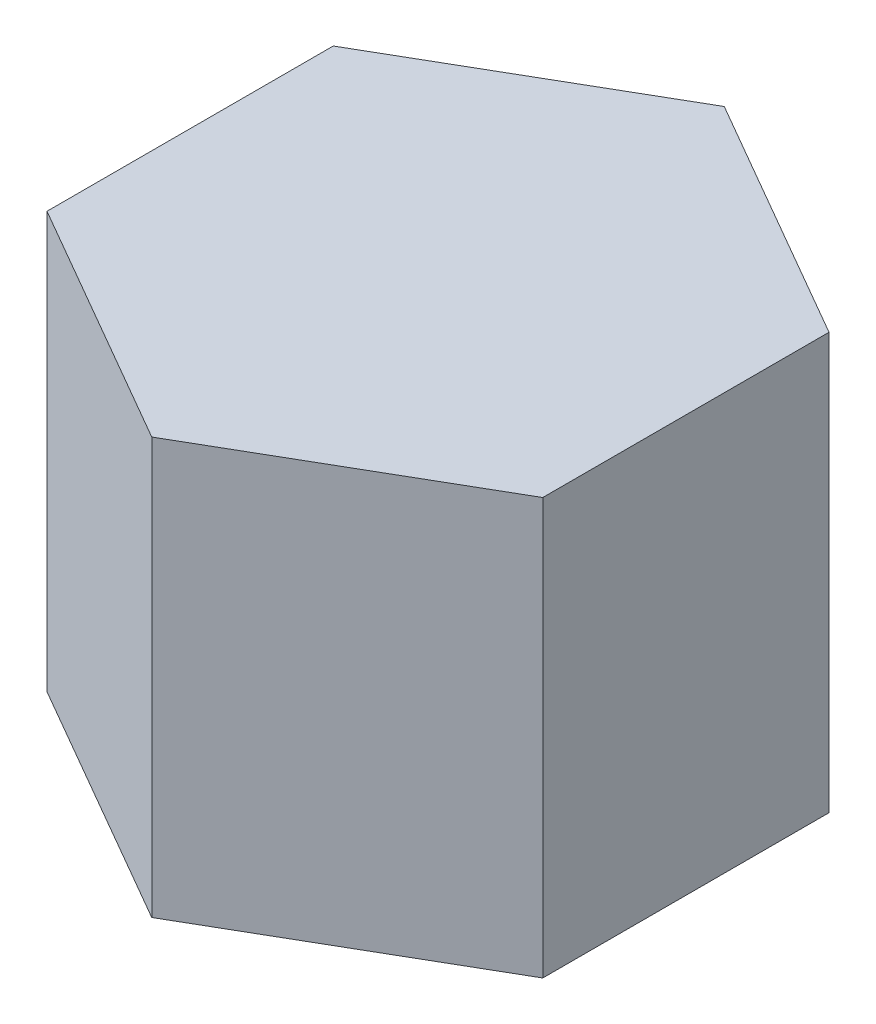
ISO-10303-21;
HEADER;
FILE_DESCRIPTION(('STEP AP214'),'2;1');
FILE_NAME('part.step','',(''),(''),'','','');
FILE_SCHEMA(('AUTOMOTIVE_DESIGN { 1 0 10303 214 1 1 1 1 }'));
ENDSEC;
DATA;
#1=APPLICATION_CONTEXT('core data for automotive mechanical design processes');
#2=APPLICATION_PROTOCOL_DEFINITION('international standard','automotive_design',2000,#1);
#3=PRODUCT_CONTEXT('',#1,'mechanical');
#4=PRODUCT('Part','Part','',(#3));
#5=PRODUCT_RELATED_PRODUCT_CATEGORY('part','',(#4));
#6=PRODUCT_DEFINITION_FORMATION('','',#4);
#7=PRODUCT_DEFINITION_CONTEXT('part definition',#1,'design');
#8=PRODUCT_DEFINITION('design','',#6,#7);
#9=PRODUCT_DEFINITION_SHAPE('','',#8);
#10=(LENGTH_UNIT() NAMED_UNIT(*) SI_UNIT(.MILLI.,.METRE.));
#11=(NAMED_UNIT(*) PLANE_ANGLE_UNIT() SI_UNIT($,.RADIAN.));
#12=(NAMED_UNIT(*) SI_UNIT($,.STERADIAN.) SOLID_ANGLE_UNIT());
#13=UNCERTAINTY_MEASURE_WITH_UNIT(LENGTH_MEASURE(1.E-05),#10,'distance_accuracy_value','');
#14=(GEOMETRIC_REPRESENTATION_CONTEXT(3) GLOBAL_UNCERTAINTY_ASSIGNED_CONTEXT((#13)) GLOBAL_UNIT_ASSIGNED_CONTEXT((#10,
#11,#12)) REPRESENTATION_CONTEXT('',''));
#15=CARTESIAN_POINT('',(0.,0.,0.));
#16=DIRECTION('',(0.,0.,1.));
#17=DIRECTION('',(1.,0.,0.));
#18=AXIS2_PLACEMENT_3D('',#15,#16,#17);
#19=CARTESIAN_POINT('',(207.839551417382,-147.556598747966,287.351844201572));
#20=DIRECTION('',(-0.499999999999943,0.,-0.866025403784471));
#21=DIRECTION('',(-0.866025403784471,0.,0.499999999999943));
#22=AXIS2_PLACEMENT_3D('',#19,#20,#21);
#23=PLANE('',#22);
#24=CARTESIAN_POINT('',(208.142660308706,-147.047793579175,287.176844201572));
#25=DIRECTION('',(-0.866025403784471,0.,0.499999999999943));
#26=VECTOR('',#25,1.);
#27=LINE('',#24,#26);
#28=CARTESIAN_POINT('',(208.142660308706,-147.047793579175,287.176844201572));
#29=VERTEX_POINT('',#28);
#30=CARTESIAN_POINT('',(207.839551417382,-147.047793579175,287.351844201572));
#31=VERTEX_POINT('',#30);
#32=EDGE_CURVE('E170',#29,#31,#27,.T.);
#33=ORIENTED_EDGE('',*,*,#32,.T.);
#34=CARTESIAN_POINT('',(207.839551417382,-147.556598747966,287.351844201572));
#35=DIRECTION('',(0.,1.,0.));
#36=VECTOR('',#35,1.);
#37=LINE('',#34,#36);
#38=CARTESIAN_POINT('',(207.839551417382,-147.556598747966,287.351844201572));
#39=VERTEX_POINT('',#38);
#40=EDGE_CURVE('E35',#39,#31,#37,.T.);
#41=ORIENTED_EDGE('',*,*,#40,.F.);
#42=CARTESIAN_POINT('',(208.142660308706,-147.556598747966,287.176844201572));
#43=DIRECTION('',(-0.866025403784471,0.,0.499999999999943));
#44=VECTOR('',#43,1.);
#45=LINE('',#42,#44);
#46=CARTESIAN_POINT('',(208.142660308706,-147.556598747966,287.176844201572));
#47=VERTEX_POINT('',#46);
#48=EDGE_CURVE('E159',#47,#39,#45,.T.);
#49=ORIENTED_EDGE('',*,*,#48,.F.);
#50=CARTESIAN_POINT('',(208.142660308706,-147.556598747966,287.176844201572));
#51=DIRECTION('',(0.,1.,0.));
#52=VECTOR('',#51,1.);
#53=LINE('',#50,#52);
#54=EDGE_CURVE('E10',#47,#29,#53,.T.);
#55=ORIENTED_EDGE('',*,*,#54,.T.);
#56=EDGE_LOOP('',(#33,#41,#49,#55));
#57=FACE_BOUND('',#56,.T.);
#58=ADVANCED_FACE('F16',(#57),#23,.F.);
#59=CARTESIAN_POINT('',(208.142660308706,-147.556598747966,291.594471220494));
#60=DIRECTION('',(-1.,0.,0.));
#61=DIRECTION('',(0.,-1.,0.));
#62=AXIS2_PLACEMENT_3D('',#59,#60,#61);
#63=PLANE('',#62);
#64=CARTESIAN_POINT('',(208.142660308706,-147.047793579175,286.826844201572));
#65=DIRECTION('',(0.,0.,1.));
#66=VECTOR('',#65,1.);
#67=LINE('',#64,#66);
#68=CARTESIAN_POINT('',(208.142660308706,-147.047793579175,286.826844201572));
#69=VERTEX_POINT('',#68);
#70=EDGE_CURVE('E167',#69,#29,#67,.T.);
#71=ORIENTED_EDGE('',*,*,#70,.T.);
#72=ORIENTED_EDGE('',*,*,#54,.F.);
#73=CARTESIAN_POINT('',(208.142660308706,-147.556598747966,286.826844201572));
#74=DIRECTION('',(0.,0.,1.));
#75=VECTOR('',#74,1.);
#76=LINE('',#73,#75);
#77=CARTESIAN_POINT('',(208.142660308706,-147.556598747966,286.826844201572));
#78=VERTEX_POINT('',#77);
#79=EDGE_CURVE('E156',#78,#47,#76,.T.);
#80=ORIENTED_EDGE('',*,*,#79,.F.);
#81=CARTESIAN_POINT('',(208.142660308706,-147.556598747966,286.826844201572));
#82=DIRECTION('',(0.,1.,0.));
#83=VECTOR('',#82,1.);
#84=LINE('',#81,#83);
#85=EDGE_CURVE('E27',#78,#69,#84,.T.);
#86=ORIENTED_EDGE('',*,*,#85,.T.);
#87=EDGE_LOOP('',(#71,#72,#80,#86));
#88=FACE_BOUND('',#87,.T.);
#89=ADVANCED_FACE('F189',(#88),#63,.F.);
#90=CARTESIAN_POINT('',(208.142660308706,-147.556598747966,286.826844201572));
#91=DIRECTION('',(-0.499999999999943,0.,0.866025403784471));
#92=DIRECTION('',(0.866025403784471,0.,0.499999999999943));
#93=AXIS2_PLACEMENT_3D('',#90,#91,#92);
#94=PLANE('',#93);
#95=CARTESIAN_POINT('',(207.839551417382,-147.047793579175,286.651844201572));
#96=DIRECTION('',(0.866025403784471,0.,0.499999999999943));
#97=VECTOR('',#96,1.);
#98=LINE('',#95,#97);
#99=CARTESIAN_POINT('',(207.839551417382,-147.047793579175,286.651844201572));
#100=VERTEX_POINT('',#99);
#101=EDGE_CURVE('E163',#100,#69,#98,.T.);
#102=ORIENTED_EDGE('',*,*,#101,.T.);
#103=ORIENTED_EDGE('',*,*,#85,.F.);
#104=CARTESIAN_POINT('',(207.839551417382,-147.556598747966,286.651844201572));
#105=DIRECTION('',(0.866025403784471,0.,0.499999999999943));
#106=VECTOR('',#105,1.);
#107=LINE('',#104,#106);
#108=CARTESIAN_POINT('',(207.839551417382,-147.556598747966,286.651844201572));
#109=VERTEX_POINT('',#108);
#110=EDGE_CURVE('E106',#109,#78,#107,.T.);
#111=ORIENTED_EDGE('',*,*,#110,.F.);
#112=CARTESIAN_POINT('',(207.839551417382,-147.556598747966,286.651844201572));
#113=DIRECTION('',(0.,1.,0.));
#114=VECTOR('',#113,1.);
#115=LINE('',#112,#114);
#116=EDGE_CURVE('E94',#109,#100,#115,.T.);
#117=ORIENTED_EDGE('',*,*,#116,.T.);
#118=EDGE_LOOP('',(#102,#103,#111,#117));
#119=FACE_BOUND('',#118,.T.);
#120=ADVANCED_FACE('F198',(#119),#94,.F.);
#121=CARTESIAN_POINT('',(207.839551417382,-147.556598747966,286.651844201572));
#122=DIRECTION('',(0.499999999999978,0.,0.866025403784452));
#123=DIRECTION('',(0.866025403784452,0.,-0.499999999999978));
#124=AXIS2_PLACEMENT_3D('',#121,#122,#123);
#125=PLANE('',#124);
#126=CARTESIAN_POINT('',(207.536442526057,-147.047793579175,286.826844201572));
#127=DIRECTION('',(0.866025403784452,0.,-0.499999999999978));
#128=VECTOR('',#127,1.);
#129=LINE('',#126,#128);
#130=CARTESIAN_POINT('',(207.536442526057,-147.047793579175,286.826844201572));
#131=VERTEX_POINT('',#130);
#132=EDGE_CURVE('E162',#131,#100,#129,.T.);
#133=ORIENTED_EDGE('',*,*,#132,.T.);
#134=ORIENTED_EDGE('',*,*,#116,.F.);
#135=CARTESIAN_POINT('',(207.536442526057,-147.556598747966,286.826844201572));
#136=DIRECTION('',(0.866025403784452,0.,-0.499999999999978));
#137=VECTOR('',#136,1.);
#138=LINE('',#135,#137);
#139=CARTESIAN_POINT('',(207.536442526057,-147.556598747966,286.826844201572));
#140=VERTEX_POINT('',#139);
#141=EDGE_CURVE('E98',#140,#109,#138,.T.);
#142=ORIENTED_EDGE('',*,*,#141,.F.);
#143=CARTESIAN_POINT('',(207.536442526057,-147.556598747966,286.826844201572));
#144=DIRECTION('',(0.,1.,0.));
#145=VECTOR('',#144,1.);
#146=LINE('',#143,#145);
#147=EDGE_CURVE('E79',#140,#131,#146,.T.);
#148=ORIENTED_EDGE('',*,*,#147,.T.);
#149=EDGE_LOOP('',(#133,#134,#142,#148));
#150=FACE_BOUND('',#149,.T.);
#151=ADVANCED_FACE('F100',(#150),#125,.F.);
#152=CARTESIAN_POINT('',(207.536442526057,-147.556598747966,291.594471220494));
#153=DIRECTION('',(1.,0.,0.));
#154=DIRECTION('',(0.,1.,0.));
#155=AXIS2_PLACEMENT_3D('',#152,#153,#154);
#156=PLANE('',#155);
#157=CARTESIAN_POINT('',(207.536442526057,-147.047793579175,287.176844201572));
#158=DIRECTION('',(0.,0.,-1.));
#159=VECTOR('',#158,1.);
#160=LINE('',#157,#159);
#161=CARTESIAN_POINT('',(207.536442526057,-147.047793579175,287.176844201572));
#162=VERTEX_POINT('',#161);
#163=EDGE_CURVE('E88',#162,#131,#160,.T.);
#164=ORIENTED_EDGE('',*,*,#163,.T.);
#165=ORIENTED_EDGE('',*,*,#147,.F.);
#166=CARTESIAN_POINT('',(207.536442526057,-147.556598747966,287.176844201572));
#167=DIRECTION('',(0.,0.,-1.));
#168=VECTOR('',#167,1.);
#169=LINE('',#166,#168);
#170=CARTESIAN_POINT('',(207.536442526057,-147.556598747966,287.176844201572));
#171=VERTEX_POINT('',#170);
#172=EDGE_CURVE('E84',#171,#140,#169,.T.);
#173=ORIENTED_EDGE('',*,*,#172,.F.);
#174=CARTESIAN_POINT('',(207.536442526057,-147.556598747966,287.176844201572));
#175=DIRECTION('',(0.,1.,0.));
#176=VECTOR('',#175,1.);
#177=LINE('',#174,#176);
#178=EDGE_CURVE('E58',#171,#162,#177,.T.);
#179=ORIENTED_EDGE('',*,*,#178,.T.);
#180=EDGE_LOOP('',(#164,#165,#173,#179));
#181=FACE_BOUND('',#180,.T.);
#182=ADVANCED_FACE('F82',(#181),#156,.F.);
#183=CARTESIAN_POINT('',(207.536442526057,-147.556598747966,287.176844201572));
#184=DIRECTION('',(0.499999999999978,0.,-0.866025403784452));
#185=DIRECTION('',(-0.866025403784452,0.,-0.499999999999978));
#186=AXIS2_PLACEMENT_3D('',#183,#184,#185);
#187=PLANE('',#186);
#188=CARTESIAN_POINT('',(207.839551417382,-147.047793579175,287.351844201572));
#189=DIRECTION('',(-0.866025403784452,0.,-0.499999999999978));
#190=VECTOR('',#189,1.);
#191=LINE('',#188,#190);
#192=EDGE_CURVE('E160',#31,#162,#191,.T.);
#193=ORIENTED_EDGE('',*,*,#192,.T.);
#194=ORIENTED_EDGE('',*,*,#178,.F.);
#195=CARTESIAN_POINT('',(207.839551417382,-147.556598747966,287.351844201572));
#196=DIRECTION('',(-0.866025403784452,0.,-0.499999999999978));
#197=VECTOR('',#196,1.);
#198=LINE('',#195,#197);
#199=EDGE_CURVE('E112',#39,#171,#198,.T.);
#200=ORIENTED_EDGE('',*,*,#199,.F.);
#201=ORIENTED_EDGE('',*,*,#40,.T.);
#202=EDGE_LOOP('',(#193,#194,#200,#201));
#203=FACE_BOUND('',#202,.T.);
#204=ADVANCED_FACE('F131',(#203),#187,.F.);
#205=CARTESIAN_POINT('',(206.491105863044,-147.556598747966,291.594471220494));
#206=DIRECTION('',(0.,1.,0.));
#207=DIRECTION('',(-1.,0.,0.));
#208=AXIS2_PLACEMENT_3D('',#205,#206,#207);
#209=PLANE('',#208);
#210=ORIENTED_EDGE('',*,*,#48,.T.);
#211=ORIENTED_EDGE('',*,*,#199,.T.);
#212=ORIENTED_EDGE('',*,*,#172,.T.);
#213=ORIENTED_EDGE('',*,*,#141,.T.);
#214=ORIENTED_EDGE('',*,*,#110,.T.);
#215=ORIENTED_EDGE('',*,*,#79,.T.);
#216=EDGE_LOOP('',(#210,#211,#212,#213,#214,#215));
#217=FACE_BOUND('',#216,.T.);
#218=ADVANCED_FACE('F111',(#217),#209,.F.);
#219=CARTESIAN_POINT('',(206.491105863044,-147.047793579175,291.594471220494));
#220=DIRECTION('',(0.,1.,0.));
#221=DIRECTION('',(-1.,0.,0.));
#222=AXIS2_PLACEMENT_3D('',#219,#220,#221);
#223=PLANE('',#222);
#224=ORIENTED_EDGE('',*,*,#32,.F.);
#225=ORIENTED_EDGE('',*,*,#70,.F.);
#226=ORIENTED_EDGE('',*,*,#101,.F.);
#227=ORIENTED_EDGE('',*,*,#132,.F.);
#228=ORIENTED_EDGE('',*,*,#163,.F.);
#229=ORIENTED_EDGE('',*,*,#192,.F.);
#230=EDGE_LOOP('',(#224,#225,#226,#227,#228,#229));
#231=FACE_BOUND('',#230,.T.);
#232=ADVANCED_FACE('F130',(#231),#223,.T.);
#233=CLOSED_SHELL('',(#58,#89,#120,#151,#182,#204,#218,#232));
#234=MANIFOLD_SOLID_BREP('B1',#233);
#235=ADVANCED_BREP_SHAPE_REPRESENTATION('',(#18,#234),#14);
#236=SHAPE_DEFINITION_REPRESENTATION(#9,#235);
ENDSEC;
END-ISO-10303-21;
